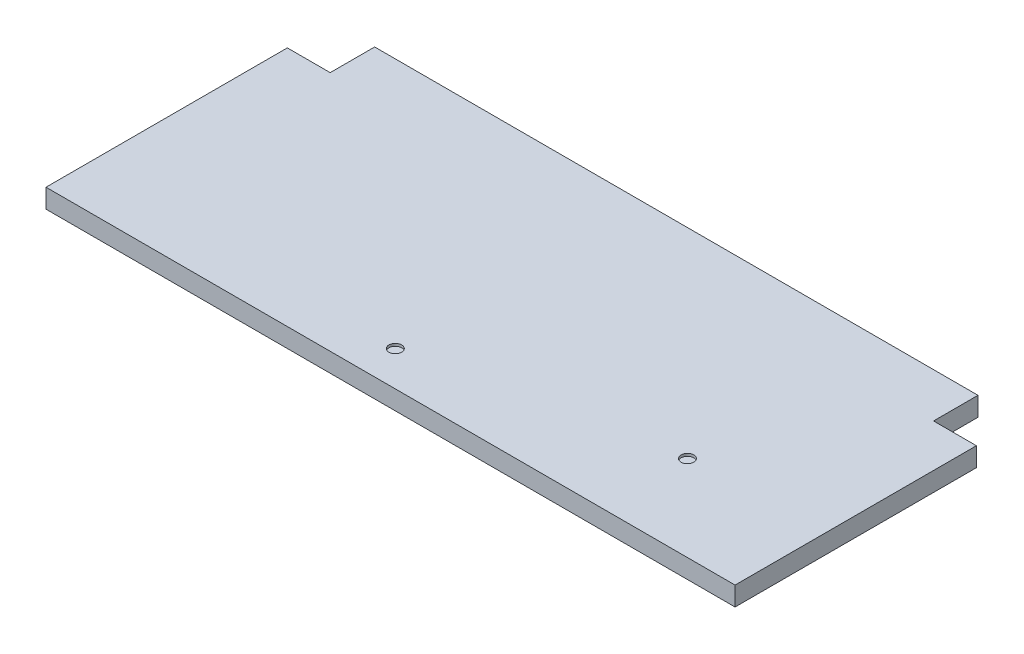
ISO-10303-21;
HEADER;
FILE_DESCRIPTION(('STEP AP214'),'2;1');
FILE_NAME('part.step','',(''),(''),'','','');
FILE_SCHEMA(('AUTOMOTIVE_DESIGN { 1 0 10303 214 1 1 1 1 }'));
ENDSEC;
DATA;
#1=APPLICATION_CONTEXT('core data for automotive mechanical design processes');
#2=APPLICATION_PROTOCOL_DEFINITION('international standard','automotive_design',2000,#1);
#3=PRODUCT_CONTEXT('',#1,'mechanical');
#4=PRODUCT('Part','Part','',(#3));
#5=PRODUCT_RELATED_PRODUCT_CATEGORY('part','',(#4));
#6=PRODUCT_DEFINITION_FORMATION('','',#4);
#7=PRODUCT_DEFINITION_CONTEXT('part definition',#1,'design');
#8=PRODUCT_DEFINITION('design','',#6,#7);
#9=PRODUCT_DEFINITION_SHAPE('','',#8);
#10=(LENGTH_UNIT() NAMED_UNIT(*) SI_UNIT(.MILLI.,.METRE.));
#11=(NAMED_UNIT(*) PLANE_ANGLE_UNIT() SI_UNIT($,.RADIAN.));
#12=(NAMED_UNIT(*) SI_UNIT($,.STERADIAN.) SOLID_ANGLE_UNIT());
#13=UNCERTAINTY_MEASURE_WITH_UNIT(LENGTH_MEASURE(1.E-05),#10,'distance_accuracy_value','');
#14=(GEOMETRIC_REPRESENTATION_CONTEXT(3) GLOBAL_UNCERTAINTY_ASSIGNED_CONTEXT((#13)) GLOBAL_UNIT_ASSIGNED_CONTEXT((#10,
#11,#12)) REPRESENTATION_CONTEXT('',''));
#15=CARTESIAN_POINT('',(0.,0.,0.));
#16=DIRECTION('',(0.,0.,1.));
#17=DIRECTION('',(1.,0.,0.));
#18=AXIS2_PLACEMENT_3D('',#15,#16,#17);
#19=CARTESIAN_POINT('',(0.,19.05,0.));
#20=DIRECTION('',(1.,0.,0.));
#21=DIRECTION('',(0.,0.,-1.));
#22=AXIS2_PLACEMENT_3D('',#19,#20,#21);
#23=PLANE('',#22);
#24=DIRECTION('',(0.,0.,1.));
#25=VECTOR('',#24,1.);
#26=CARTESIAN_POINT('',(0.,0.,0.));
#27=LINE('',#26,#25);
#28=CARTESIAN_POINT('',(0.,0.,-241.3));
#29=VERTEX_POINT('',#28);
#30=CARTESIAN_POINT('',(0.,0.,0.));
#31=VERTEX_POINT('',#30);
#32=EDGE_CURVE('E133',#29,#31,#27,.T.);
#33=ORIENTED_EDGE('',*,*,#32,.T.);
#34=DIRECTION('',(0.,-1.,0.));
#35=VECTOR('',#34,1.);
#36=CARTESIAN_POINT('',(0.,19.05,0.));
#37=LINE('',#36,#35);
#38=CARTESIAN_POINT('',(0.,19.05,0.));
#39=VERTEX_POINT('',#38);
#40=EDGE_CURVE('E11',#39,#31,#37,.T.);
#41=ORIENTED_EDGE('',*,*,#40,.F.);
#42=DIRECTION('',(0.,0.,1.));
#43=VECTOR('',#42,1.);
#44=CARTESIAN_POINT('',(0.,19.05,0.));
#45=LINE('',#44,#43);
#46=CARTESIAN_POINT('',(0.,19.05,-241.3));
#47=VERTEX_POINT('',#46);
#48=EDGE_CURVE('E149',#47,#39,#45,.T.);
#49=ORIENTED_EDGE('',*,*,#48,.F.);
#50=DIRECTION('',(0.,-1.,0.));
#51=VECTOR('',#50,1.);
#52=CARTESIAN_POINT('',(0.,19.05,-241.3));
#53=LINE('',#52,#51);
#54=EDGE_CURVE('E129',#47,#29,#53,.T.);
#55=ORIENTED_EDGE('',*,*,#54,.T.);
#56=EDGE_LOOP('',(#33,#41,#49,#55));
#57=FACE_BOUND('',#56,.T.);
#58=ADVANCED_FACE('F37',(#57),#23,.F.);
#59=CARTESIAN_POINT('',(0.,19.05,0.));
#60=DIRECTION('',(0.,0.,-1.));
#61=DIRECTION('',(-1.,0.,0.));
#62=AXIS2_PLACEMENT_3D('',#59,#60,#61);
#63=PLANE('',#62);
#64=DIRECTION('',(1.,0.,0.));
#65=VECTOR('',#64,1.);
#66=CARTESIAN_POINT('',(0.,0.,0.));
#67=LINE('',#66,#65);
#68=CARTESIAN_POINT('',(688.975,0.,0.));
#69=VERTEX_POINT('',#68);
#70=EDGE_CURVE('E136',#31,#69,#67,.T.);
#71=ORIENTED_EDGE('',*,*,#70,.T.);
#72=DIRECTION('',(0.,-1.,0.));
#73=VECTOR('',#72,1.);
#74=CARTESIAN_POINT('',(688.975,19.05,0.));
#75=LINE('',#74,#73);
#76=CARTESIAN_POINT('',(688.975,19.05,0.));
#77=VERTEX_POINT('',#76);
#78=EDGE_CURVE('E45',#77,#69,#75,.T.);
#79=ORIENTED_EDGE('',*,*,#78,.F.);
#80=DIRECTION('',(1.,0.,0.));
#81=VECTOR('',#80,1.);
#82=CARTESIAN_POINT('',(0.,19.05,0.));
#83=LINE('',#82,#81);
#84=EDGE_CURVE('E96',#39,#77,#83,.T.);
#85=ORIENTED_EDGE('',*,*,#84,.F.);
#86=ORIENTED_EDGE('',*,*,#40,.T.);
#87=EDGE_LOOP('',(#71,#79,#85,#86));
#88=FACE_BOUND('',#87,.T.);
#89=ADVANCED_FACE('F223',(#88),#63,.F.);
#90=CARTESIAN_POINT('',(688.975,19.05,0.));
#91=DIRECTION('',(-1.,0.,0.));
#92=DIRECTION('',(0.,0.,1.));
#93=AXIS2_PLACEMENT_3D('',#90,#91,#92);
#94=PLANE('',#93);
#95=DIRECTION('',(0.,0.,-1.));
#96=VECTOR('',#95,1.);
#97=CARTESIAN_POINT('',(688.975,0.,0.));
#98=LINE('',#97,#96);
#99=CARTESIAN_POINT('',(688.975,0.,-241.3));
#100=VERTEX_POINT('',#99);
#101=EDGE_CURVE('E140',#69,#100,#98,.T.);
#102=ORIENTED_EDGE('',*,*,#101,.T.);
#103=DIRECTION('',(0.,-1.,0.));
#104=VECTOR('',#103,1.);
#105=CARTESIAN_POINT('',(688.975,19.05,-241.3));
#106=LINE('',#105,#104);
#107=CARTESIAN_POINT('',(688.975,19.05,-241.3));
#108=VERTEX_POINT('',#107);
#109=EDGE_CURVE('E156',#108,#100,#106,.T.);
#110=ORIENTED_EDGE('',*,*,#109,.F.);
#111=DIRECTION('',(0.,0.,-1.));
#112=VECTOR('',#111,1.);
#113=CARTESIAN_POINT('',(688.975,19.05,0.));
#114=LINE('',#113,#112);
#115=EDGE_CURVE('E164',#77,#108,#114,.T.);
#116=ORIENTED_EDGE('',*,*,#115,.F.);
#117=ORIENTED_EDGE('',*,*,#78,.T.);
#118=EDGE_LOOP('',(#102,#110,#116,#117));
#119=FACE_BOUND('',#118,.T.);
#120=ADVANCED_FACE('F162',(#119),#94,.F.);
#121=CARTESIAN_POINT('',(688.975,19.05,-241.3));
#122=DIRECTION('',(0.,0.,1.));
#123=DIRECTION('',(1.,0.,0.));
#124=AXIS2_PLACEMENT_3D('',#121,#122,#123);
#125=PLANE('',#124);
#126=DIRECTION('',(-1.,0.,0.));
#127=VECTOR('',#126,1.);
#128=CARTESIAN_POINT('',(688.975,0.,-241.3));
#129=LINE('',#128,#127);
#130=CARTESIAN_POINT('',(646.1125,0.,-241.3));
#131=VERTEX_POINT('',#130);
#132=EDGE_CURVE('E142',#100,#131,#129,.T.);
#133=ORIENTED_EDGE('',*,*,#132,.T.);
#134=DIRECTION('',(0.,-1.,0.));
#135=VECTOR('',#134,1.);
#136=CARTESIAN_POINT('',(646.1125,19.05,-241.3));
#137=LINE('',#136,#135);
#138=CARTESIAN_POINT('',(646.1125,19.05,-241.3));
#139=VERTEX_POINT('',#138);
#140=EDGE_CURVE('E153',#139,#131,#137,.T.);
#141=ORIENTED_EDGE('',*,*,#140,.F.);
#142=DIRECTION('',(-1.,0.,0.));
#143=VECTOR('',#142,1.);
#144=CARTESIAN_POINT('',(688.975,19.05,-241.3));
#145=LINE('',#144,#143);
#146=EDGE_CURVE('E176',#108,#139,#145,.T.);
#147=ORIENTED_EDGE('',*,*,#146,.F.);
#148=ORIENTED_EDGE('',*,*,#109,.T.);
#149=EDGE_LOOP('',(#133,#141,#147,#148));
#150=FACE_BOUND('',#149,.T.);
#151=ADVANCED_FACE('F172',(#150),#125,.F.);
#152=CARTESIAN_POINT('',(646.1125,19.05,-241.3));
#153=DIRECTION('',(-1.,0.,0.));
#154=DIRECTION('',(0.,0.,1.));
#155=AXIS2_PLACEMENT_3D('',#152,#153,#154);
#156=PLANE('',#155);
#157=DIRECTION('',(0.,0.,-1.));
#158=VECTOR('',#157,1.);
#159=CARTESIAN_POINT('',(646.1125,0.,-241.3));
#160=LINE('',#159,#158);
#161=CARTESIAN_POINT('',(646.1125,0.,-285.75));
#162=VERTEX_POINT('',#161);
#163=EDGE_CURVE('E144',#131,#162,#160,.T.);
#164=ORIENTED_EDGE('',*,*,#163,.T.);
#165=DIRECTION('',(0.,-1.,0.));
#166=VECTOR('',#165,1.);
#167=CARTESIAN_POINT('',(646.1125,19.05,-285.75));
#168=LINE('',#167,#166);
#169=CARTESIAN_POINT('',(646.1125,19.05,-285.75));
#170=VERTEX_POINT('',#169);
#171=EDGE_CURVE('E124',#170,#162,#168,.T.);
#172=ORIENTED_EDGE('',*,*,#171,.F.);
#173=DIRECTION('',(0.,0.,-1.));
#174=VECTOR('',#173,1.);
#175=CARTESIAN_POINT('',(646.1125,19.05,-241.3));
#176=LINE('',#175,#174);
#177=EDGE_CURVE('E115',#139,#170,#176,.T.);
#178=ORIENTED_EDGE('',*,*,#177,.F.);
#179=ORIENTED_EDGE('',*,*,#140,.T.);
#180=EDGE_LOOP('',(#164,#172,#178,#179));
#181=FACE_BOUND('',#180,.T.);
#182=ADVANCED_FACE('F175',(#181),#156,.F.);
#183=CARTESIAN_POINT('',(42.8625,19.05,-285.75));
#184=DIRECTION('',(0.,0.,1.));
#185=DIRECTION('',(1.,0.,0.));
#186=AXIS2_PLACEMENT_3D('',#183,#184,#185);
#187=PLANE('',#186);
#188=DIRECTION('',(-1.,0.,0.));
#189=VECTOR('',#188,1.);
#190=CARTESIAN_POINT('',(42.8625,0.,-285.75));
#191=LINE('',#190,#189);
#192=CARTESIAN_POINT('',(42.8625,0.,-285.75));
#193=VERTEX_POINT('',#192);
#194=EDGE_CURVE('E123',#162,#193,#191,.T.);
#195=ORIENTED_EDGE('',*,*,#194,.T.);
#196=DIRECTION('',(0.,-1.,0.));
#197=VECTOR('',#196,1.);
#198=CARTESIAN_POINT('',(42.8625,19.05,-285.75));
#199=LINE('',#198,#197);
#200=CARTESIAN_POINT('',(42.8625,19.05,-285.75));
#201=VERTEX_POINT('',#200);
#202=EDGE_CURVE('E120',#201,#193,#199,.T.);
#203=ORIENTED_EDGE('',*,*,#202,.F.);
#204=DIRECTION('',(-1.,0.,0.));
#205=VECTOR('',#204,1.);
#206=CARTESIAN_POINT('',(42.8625,19.05,-285.75));
#207=LINE('',#206,#205);
#208=EDGE_CURVE('E109',#170,#201,#207,.T.);
#209=ORIENTED_EDGE('',*,*,#208,.F.);
#210=ORIENTED_EDGE('',*,*,#171,.T.);
#211=EDGE_LOOP('',(#195,#203,#209,#210));
#212=FACE_BOUND('',#211,.T.);
#213=ADVANCED_FACE('F121',(#212),#187,.F.);
#214=CARTESIAN_POINT('',(42.8625,19.05,-241.3));
#215=DIRECTION('',(1.,0.,0.));
#216=DIRECTION('',(0.,0.,-1.));
#217=AXIS2_PLACEMENT_3D('',#214,#215,#216);
#218=PLANE('',#217);
#219=DIRECTION('',(0.,0.,1.));
#220=VECTOR('',#219,1.);
#221=CARTESIAN_POINT('',(42.8625,0.,-241.3));
#222=LINE('',#221,#220);
#223=CARTESIAN_POINT('',(42.8625,0.,-241.3));
#224=VERTEX_POINT('',#223);
#225=EDGE_CURVE('E82',#193,#224,#222,.T.);
#226=ORIENTED_EDGE('',*,*,#225,.T.);
#227=DIRECTION('',(0.,-1.,0.));
#228=VECTOR('',#227,1.);
#229=CARTESIAN_POINT('',(42.8625,19.05,-241.3));
#230=LINE('',#229,#228);
#231=CARTESIAN_POINT('',(42.8625,19.05,-241.3));
#232=VERTEX_POINT('',#231);
#233=EDGE_CURVE('E125',#232,#224,#230,.T.);
#234=ORIENTED_EDGE('',*,*,#233,.F.);
#235=DIRECTION('',(0.,0.,1.));
#236=VECTOR('',#235,1.);
#237=CARTESIAN_POINT('',(42.8625,19.05,-241.3));
#238=LINE('',#237,#236);
#239=EDGE_CURVE('E113',#201,#232,#238,.T.);
#240=ORIENTED_EDGE('',*,*,#239,.F.);
#241=ORIENTED_EDGE('',*,*,#202,.T.);
#242=EDGE_LOOP('',(#226,#234,#240,#241));
#243=FACE_BOUND('',#242,.T.);
#244=ADVANCED_FACE('F127',(#243),#218,.F.);
#245=CARTESIAN_POINT('',(0.,19.05,-241.3));
#246=DIRECTION('',(0.,0.,1.));
#247=DIRECTION('',(1.,0.,0.));
#248=AXIS2_PLACEMENT_3D('',#245,#246,#247);
#249=PLANE('',#248);
#250=DIRECTION('',(-1.,0.,0.));
#251=VECTOR('',#250,1.);
#252=CARTESIAN_POINT('',(0.,0.,-241.3));
#253=LINE('',#252,#251);
#254=EDGE_CURVE('E88',#224,#29,#253,.T.);
#255=ORIENTED_EDGE('',*,*,#254,.T.);
#256=ORIENTED_EDGE('',*,*,#54,.F.);
#257=DIRECTION('',(-1.,0.,0.));
#258=VECTOR('',#257,1.);
#259=CARTESIAN_POINT('',(0.,19.05,-241.3));
#260=LINE('',#259,#258);
#261=EDGE_CURVE('E53',#232,#47,#260,.T.);
#262=ORIENTED_EDGE('',*,*,#261,.F.);
#263=ORIENTED_EDGE('',*,*,#233,.T.);
#264=EDGE_LOOP('',(#255,#256,#262,#263));
#265=FACE_BOUND('',#264,.T.);
#266=ADVANCED_FACE('F206',(#265),#249,.F.);
#267=CARTESIAN_POINT('',(0.,19.05,0.));
#268=DIRECTION('',(0.,-1.,0.));
#269=DIRECTION('',(0.,0.,-1.));
#270=AXIS2_PLACEMENT_3D('',#267,#268,#269);
#271=PLANE('',#270);
#272=CARTESIAN_POINT('',(314.325,19.05,-34.925));
#273=DIRECTION('',(0.,1.,0.));
#274=DIRECTION('',(0.,0.,1.));
#275=AXIS2_PLACEMENT_3D('',#272,#273,#274);
#276=CIRCLE('',#275,6.35);
#277=CARTESIAN_POINT('',(314.325,19.05,-28.575));
#278=VERTEX_POINT('',#277);
#279=EDGE_CURVE('E189',#278,#278,#276,.T.);
#280=ORIENTED_EDGE('',*,*,#279,.F.);
#281=EDGE_LOOP('',(#280));
#282=FACE_BOUND('',#281,.T.);
#283=CARTESIAN_POINT('',(555.625,19.05,-85.725));
#284=DIRECTION('',(0.,1.,0.));
#285=DIRECTION('',(0.,0.,1.));
#286=AXIS2_PLACEMENT_3D('',#283,#284,#285);
#287=CIRCLE('',#286,6.34999999999994);
#288=CARTESIAN_POINT('',(555.625,19.05,-79.3750000000001));
#289=VERTEX_POINT('',#288);
#290=EDGE_CURVE('E183',#289,#289,#287,.T.);
#291=ORIENTED_EDGE('',*,*,#290,.F.);
#292=EDGE_LOOP('',(#291));
#293=FACE_BOUND('',#292,.T.);
#294=ORIENTED_EDGE('',*,*,#48,.T.);
#295=ORIENTED_EDGE('',*,*,#84,.T.);
#296=ORIENTED_EDGE('',*,*,#115,.T.);
#297=ORIENTED_EDGE('',*,*,#146,.T.);
#298=ORIENTED_EDGE('',*,*,#177,.T.);
#299=ORIENTED_EDGE('',*,*,#208,.T.);
#300=ORIENTED_EDGE('',*,*,#239,.T.);
#301=ORIENTED_EDGE('',*,*,#261,.T.);
#302=EDGE_LOOP('',(#294,#295,#296,#297,#298,#299,#300,#301));
#303=FACE_BOUND('',#302,.T.);
#304=ADVANCED_FACE('F111',(#282,#293,#303),#271,.F.);
#305=CARTESIAN_POINT('',(0.,0.,0.));
#306=DIRECTION('',(0.,-1.,0.));
#307=DIRECTION('',(0.,0.,-1.));
#308=AXIS2_PLACEMENT_3D('',#305,#306,#307);
#309=PLANE('',#308);
#310=ORIENTED_EDGE('',*,*,#32,.F.);
#311=ORIENTED_EDGE('',*,*,#254,.F.);
#312=ORIENTED_EDGE('',*,*,#225,.F.);
#313=ORIENTED_EDGE('',*,*,#194,.F.);
#314=ORIENTED_EDGE('',*,*,#163,.F.);
#315=ORIENTED_EDGE('',*,*,#132,.F.);
#316=ORIENTED_EDGE('',*,*,#101,.F.);
#317=ORIENTED_EDGE('',*,*,#70,.F.);
#318=EDGE_LOOP('',(#310,#311,#312,#313,#314,#315,#316,#317));
#319=FACE_BOUND('',#318,.T.);
#320=ADVANCED_FACE('F168',(#319),#309,.T.);
#321=CARTESIAN_POINT('',(555.625,16.51,-85.725));
#322=DIRECTION('',(0.,1.,0.));
#323=DIRECTION('',(0.,0.,1.));
#324=AXIS2_PLACEMENT_3D('',#321,#322,#323);
#325=CYLINDRICAL_SURFACE('',#324,6.34999999999994);
#326=CARTESIAN_POINT('',(555.625,16.51,-85.725));
#327=DIRECTION('',(0.,1.,0.));
#328=DIRECTION('',(0.,0.,1.));
#329=AXIS2_PLACEMENT_3D('',#326,#327,#328);
#330=CIRCLE('',#329,6.34999999999994);
#331=CARTESIAN_POINT('',(555.625,16.51,-79.3750000000001));
#332=VERTEX_POINT('',#331);
#333=EDGE_CURVE('E137',#332,#332,#330,.T.);
#334=ORIENTED_EDGE('',*,*,#333,.F.);
#335=EDGE_LOOP('',(#334));
#336=FACE_BOUND('',#335,.T.);
#337=ORIENTED_EDGE('',*,*,#290,.T.);
#338=EDGE_LOOP('',(#337));
#339=FACE_BOUND('',#338,.T.);
#340=ADVANCED_FACE('F210',(#336,#339),#325,.F.);
#341=CARTESIAN_POINT('',(555.625,16.51,-85.725));
#342=DIRECTION('',(0.,1.,0.));
#343=DIRECTION('',(0.,0.,1.));
#344=AXIS2_PLACEMENT_3D('',#341,#342,#343);
#345=PLANE('',#344);
#346=ORIENTED_EDGE('',*,*,#333,.T.);
#347=EDGE_LOOP('',(#346));
#348=FACE_BOUND('',#347,.T.);
#349=ADVANCED_FACE('F200',(#348),#345,.T.);
#350=CARTESIAN_POINT('',(314.325,16.51,-34.925));
#351=DIRECTION('',(0.,1.,0.));
#352=DIRECTION('',(0.,0.,1.));
#353=AXIS2_PLACEMENT_3D('',#350,#351,#352);
#354=CYLINDRICAL_SURFACE('',#353,6.35);
#355=CARTESIAN_POINT('',(314.325,16.51,-34.925));
#356=DIRECTION('',(0.,1.,0.));
#357=DIRECTION('',(0.,0.,1.));
#358=AXIS2_PLACEMENT_3D('',#355,#356,#357);
#359=CIRCLE('',#358,6.35);
#360=CARTESIAN_POINT('',(314.325,16.51,-28.575));
#361=VERTEX_POINT('',#360);
#362=EDGE_CURVE('E186',#361,#361,#359,.T.);
#363=ORIENTED_EDGE('',*,*,#362,.F.);
#364=EDGE_LOOP('',(#363));
#365=FACE_BOUND('',#364,.T.);
#366=ORIENTED_EDGE('',*,*,#279,.T.);
#367=EDGE_LOOP('',(#366));
#368=FACE_BOUND('',#367,.T.);
#369=ADVANCED_FACE('F197',(#365,#368),#354,.F.);
#370=CARTESIAN_POINT('',(314.325,16.51,-34.925));
#371=DIRECTION('',(0.,1.,0.));
#372=DIRECTION('',(0.,0.,1.));
#373=AXIS2_PLACEMENT_3D('',#370,#371,#372);
#374=PLANE('',#373);
#375=ORIENTED_EDGE('',*,*,#362,.T.);
#376=EDGE_LOOP('',(#375));
#377=FACE_BOUND('',#376,.T.);
#378=ADVANCED_FACE('F195',(#377),#374,.T.);
#379=CLOSED_SHELL('',(#58,#89,#120,#151,#182,#213,#244,#266,#304,#320,#340,#349,#369,#378));
#380=MANIFOLD_SOLID_BREP('B2',#379);
#381=ADVANCED_BREP_SHAPE_REPRESENTATION('',(#18,#380),#14);
#382=SHAPE_DEFINITION_REPRESENTATION(#9,#381);
ENDSEC;
END-ISO-10303-21;
